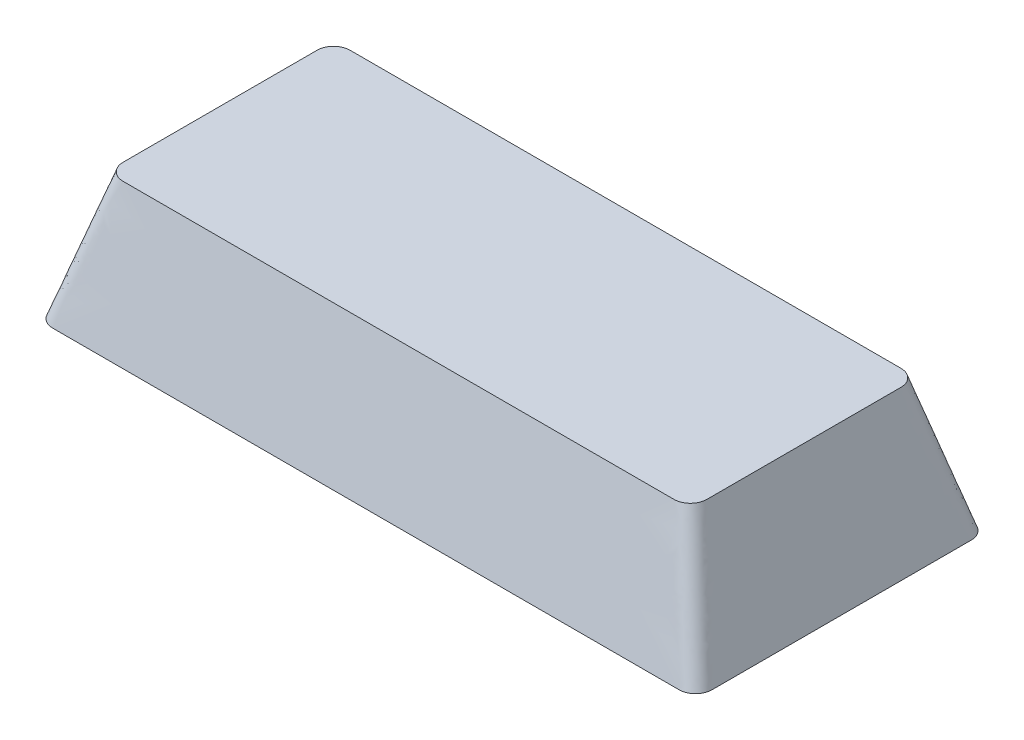
ISO-10303-21;
HEADER;
FILE_DESCRIPTION(('STEP AP214'),'2;1');
FILE_NAME('part.step','',(''),(''),'','','');
FILE_SCHEMA(('AUTOMOTIVE_DESIGN { 1 0 10303 214 1 1 1 1 }'));
ENDSEC;
DATA;
#1=APPLICATION_CONTEXT('core data for automotive mechanical design processes');
#2=APPLICATION_PROTOCOL_DEFINITION('international standard','automotive_design',2000,#1);
#3=PRODUCT_CONTEXT('',#1,'mechanical');
#4=PRODUCT('Part','Part','',(#3));
#5=PRODUCT_RELATED_PRODUCT_CATEGORY('part','',(#4));
#6=PRODUCT_DEFINITION_FORMATION('','',#4);
#7=PRODUCT_DEFINITION_CONTEXT('part definition',#1,'design');
#8=PRODUCT_DEFINITION('design','',#6,#7);
#9=PRODUCT_DEFINITION_SHAPE('','',#8);
#10=(LENGTH_UNIT() NAMED_UNIT(*) SI_UNIT(.MILLI.,.METRE.));
#11=(NAMED_UNIT(*) PLANE_ANGLE_UNIT() SI_UNIT($,.RADIAN.));
#12=(NAMED_UNIT(*) SI_UNIT($,.STERADIAN.) SOLID_ANGLE_UNIT());
#13=UNCERTAINTY_MEASURE_WITH_UNIT(LENGTH_MEASURE(1.E-05),#10,'distance_accuracy_value','');
#14=(GEOMETRIC_REPRESENTATION_CONTEXT(3) GLOBAL_UNCERTAINTY_ASSIGNED_CONTEXT((#13)) GLOBAL_UNIT_ASSIGNED_CONTEXT((#10,
#11,#12)) REPRESENTATION_CONTEXT('',''));
#15=CARTESIAN_POINT('',(0.,0.,0.));
#16=DIRECTION('',(0.,0.,1.));
#17=DIRECTION('',(1.,0.,0.));
#18=AXIS2_PLACEMENT_3D('',#15,#16,#17);
#19=CARTESIAN_POINT('',(-19.304,0.,-7.9883));
#20=DIRECTION('',(0.,-1.,0.));
#21=DIRECTION('',(0.,0.,-1.));
#22=AXIS2_PLACEMENT_3D('',#19,#20,#21);
#23=PLANE('',#22);
#24=CARTESIAN_POINT('',(-19.304,0.,-7.9883));
#25=DIRECTION('',(0.,1.,0.));
#26=DIRECTION('',(0.,0.,-1.));
#27=AXIS2_PLACEMENT_3D('',#24,#25,#26);
#28=CIRCLE('',#27,1.016);
#29=CARTESIAN_POINT('',(-19.3039999999098,0.,-9.0043));
#30=VERTEX_POINT('',#29);
#31=CARTESIAN_POINT('',(-20.32,0.,-7.9883));
#32=VERTEX_POINT('',#31);
#33=EDGE_CURVE('E308',#30,#32,#28,.T.);
#34=ORIENTED_EDGE('',*,*,#33,.F.);
#35=DIRECTION('',(-1.,0.,0.));
#36=VECTOR('',#35,1.);
#37=CARTESIAN_POINT('',(-19.304,0.,-9.0043));
#38=LINE('',#37,#36);
#39=CARTESIAN_POINT('',(19.3039999999883,0.,-9.0043));
#40=VERTEX_POINT('',#39);
#41=EDGE_CURVE('E540',#40,#30,#38,.T.);
#42=ORIENTED_EDGE('',*,*,#41,.F.);
#43=CARTESIAN_POINT('',(19.304,0.,-7.9883));
#44=DIRECTION('',(0.,1.,0.));
#45=DIRECTION('',(0.,0.,-1.));
#46=AXIS2_PLACEMENT_3D('',#43,#44,#45);
#47=CIRCLE('',#46,1.016);
#48=CARTESIAN_POINT('',(20.32,0.,-7.98829999974556));
#49=VERTEX_POINT('',#48);
#50=EDGE_CURVE('E531',#49,#40,#47,.T.);
#51=ORIENTED_EDGE('',*,*,#50,.F.);
#52=DIRECTION('',(0.,0.,-1.));
#53=VECTOR('',#52,1.);
#54=CARTESIAN_POINT('',(20.32,0.,7.9883));
#55=LINE('',#54,#53);
#56=CARTESIAN_POINT('',(20.32,0.,7.98829999944352));
#57=VERTEX_POINT('',#56);
#58=EDGE_CURVE('E522',#57,#49,#55,.T.);
#59=ORIENTED_EDGE('',*,*,#58,.F.);
#60=CARTESIAN_POINT('',(19.304,0.,7.9883));
#61=DIRECTION('',(0.,1.,0.));
#62=DIRECTION('',(0.,0.,1.));
#63=AXIS2_PLACEMENT_3D('',#60,#61,#62);
#64=CIRCLE('',#63,1.016);
#65=CARTESIAN_POINT('',(19.3039999999101,0.,9.0043));
#66=VERTEX_POINT('',#65);
#67=EDGE_CURVE('E513',#66,#57,#64,.T.);
#68=ORIENTED_EDGE('',*,*,#67,.F.);
#69=DIRECTION('',(1.,0.,0.));
#70=VECTOR('',#69,1.);
#71=CARTESIAN_POINT('',(-19.304,0.,9.0043));
#72=LINE('',#71,#70);
#73=CARTESIAN_POINT('',(-19.3039999999883,0.,9.0043));
#74=VERTEX_POINT('',#73);
#75=EDGE_CURVE('E507',#74,#66,#72,.T.);
#76=ORIENTED_EDGE('',*,*,#75,.F.);
#77=CARTESIAN_POINT('',(-19.304,0.,7.9883));
#78=DIRECTION('',(0.,1.,0.));
#79=DIRECTION('',(0.,0.,-1.));
#80=AXIS2_PLACEMENT_3D('',#77,#78,#79);
#81=CIRCLE('',#80,1.016);
#82=CARTESIAN_POINT('',(-20.32,0.,7.9883));
#83=VERTEX_POINT('',#82);
#84=EDGE_CURVE('E241',#83,#74,#81,.T.);
#85=ORIENTED_EDGE('',*,*,#84,.F.);
#86=DIRECTION('',(0.,0.,1.));
#87=VECTOR('',#86,1.);
#88=CARTESIAN_POINT('',(-20.32,0.,7.9883));
#89=LINE('',#88,#87);
#90=EDGE_CURVE('E12',#32,#83,#89,.T.);
#91=ORIENTED_EDGE('',*,*,#90,.F.);
#92=EDGE_LOOP('',(#34,#42,#51,#59,#68,#76,#85,#91));
#93=FACE_BOUND('',#92,.T.);
#94=ADVANCED_FACE('F231',(#93),#23,.T.);
#95=CARTESIAN_POINT('',(16.9799,8.001,-5.9817));
#96=DIRECTION('',(0.,-1.,0.));
#97=DIRECTION('',(0.,0.,-1.));
#98=AXIS2_PLACEMENT_3D('',#95,#96,#97);
#99=PLANE('',#98);
#100=CARTESIAN_POINT('',(16.9799,8.001,-5.9817));
#101=DIRECTION('',(0.,1.,0.));
#102=DIRECTION('',(0.,0.,-1.));
#103=AXIS2_PLACEMENT_3D('',#100,#101,#102);
#104=CIRCLE('',#103,1.016);
#105=CARTESIAN_POINT('',(17.9959,8.001,-5.9817));
#106=VERTEX_POINT('',#105);
#107=CARTESIAN_POINT('',(16.9799,8.001,-6.9977));
#108=VERTEX_POINT('',#107);
#109=EDGE_CURVE('E304',#106,#108,#104,.T.);
#110=ORIENTED_EDGE('',*,*,#109,.T.);
#111=DIRECTION('',(-1.,0.,0.));
#112=VECTOR('',#111,1.);
#113=CARTESIAN_POINT('',(-16.9799,8.001,-6.9977));
#114=LINE('',#113,#112);
#115=CARTESIAN_POINT('',(-16.9799,8.001,-6.9977));
#116=VERTEX_POINT('',#115);
#117=EDGE_CURVE('E296',#108,#116,#114,.T.);
#118=ORIENTED_EDGE('',*,*,#117,.T.);
#119=CARTESIAN_POINT('',(-16.9799,8.001,-5.9817));
#120=DIRECTION('',(0.,1.,0.));
#121=DIRECTION('',(0.,0.,-1.));
#122=AXIS2_PLACEMENT_3D('',#119,#120,#121);
#123=CIRCLE('',#122,1.016);
#124=CARTESIAN_POINT('',(-17.9959,8.001,-5.9817));
#125=VERTEX_POINT('',#124);
#126=EDGE_CURVE('E300',#116,#125,#123,.T.);
#127=ORIENTED_EDGE('',*,*,#126,.T.);
#128=DIRECTION('',(0.,0.,1.));
#129=VECTOR('',#128,1.);
#130=CARTESIAN_POINT('',(-17.9959,8.001,5.9817));
#131=LINE('',#130,#129);
#132=CARTESIAN_POINT('',(-17.9959,8.001,5.9817));
#133=VERTEX_POINT('',#132);
#134=EDGE_CURVE('E315',#125,#133,#131,.T.);
#135=ORIENTED_EDGE('',*,*,#134,.T.);
#136=CARTESIAN_POINT('',(-16.9799,8.001,5.9817));
#137=DIRECTION('',(0.,1.,0.));
#138=DIRECTION('',(0.,0.,-1.));
#139=AXIS2_PLACEMENT_3D('',#136,#137,#138);
#140=CIRCLE('',#139,1.016);
#141=CARTESIAN_POINT('',(-16.9799,8.001,6.9977));
#142=VERTEX_POINT('',#141);
#143=EDGE_CURVE('E439',#133,#142,#140,.T.);
#144=ORIENTED_EDGE('',*,*,#143,.T.);
#145=DIRECTION('',(1.,0.,0.));
#146=VECTOR('',#145,1.);
#147=CARTESIAN_POINT('',(-16.9799,8.001,6.9977));
#148=LINE('',#147,#146);
#149=CARTESIAN_POINT('',(16.9799,8.001,6.9977));
#150=VERTEX_POINT('',#149);
#151=EDGE_CURVE('E456',#142,#150,#148,.T.);
#152=ORIENTED_EDGE('',*,*,#151,.T.);
#153=CARTESIAN_POINT('',(16.9799,8.001,5.9817));
#154=DIRECTION('',(0.,1.,0.));
#155=DIRECTION('',(0.,0.,1.));
#156=AXIS2_PLACEMENT_3D('',#153,#154,#155);
#157=CIRCLE('',#156,1.016);
#158=CARTESIAN_POINT('',(17.9959,8.001,5.9817));
#159=VERTEX_POINT('',#158);
#160=EDGE_CURVE('E459',#150,#159,#157,.T.);
#161=ORIENTED_EDGE('',*,*,#160,.T.);
#162=DIRECTION('',(0.,0.,-1.));
#163=VECTOR('',#162,1.);
#164=CARTESIAN_POINT('',(17.9959,8.001,5.9817));
#165=LINE('',#164,#163);
#166=EDGE_CURVE('E477',#159,#106,#165,.T.);
#167=ORIENTED_EDGE('',*,*,#166,.T.);
#168=EDGE_LOOP('',(#110,#118,#127,#135,#144,#152,#161,#167));
#169=FACE_BOUND('',#168,.T.);
#170=ADVANCED_FACE('F299',(#169),#99,.F.);
#171=CARTESIAN_POINT('',(-16.9798999992183,8.001,-6.9977));
#172=CARTESIAN_POINT('',(-19.3039999991161,0.,-9.0043));
#173=CARTESIAN_POINT('',(-14.1423805942969,8.001,-6.9977));
#174=CARTESIAN_POINT('',(-16.0955317191843,0.,-9.0043));
#175=CARTESIAN_POINT('',(-8.47869031546138,8.001,-6.99770000000001));
#176=CARTESIAN_POINT('',(-9.66535195745911,0.,-9.0043));
#177=CARTESIAN_POINT('',(0.,8.001,-6.99769999999999));
#178=CARTESIAN_POINT('',(0.,0.,-9.0043));
#179=CARTESIAN_POINT('',(8.47869031546139,8.001,-6.99770000000001));
#180=CARTESIAN_POINT('',(9.6653519574591,0.,-9.0043));
#181=CARTESIAN_POINT('',(14.1423805942969,8.001,-6.9977));
#182=CARTESIAN_POINT('',(16.0955317191843,0.,-9.0043));
#183=CARTESIAN_POINT('',(17.1053580158159,8.001,-6.9977));
#184=CARTESIAN_POINT('',(19.4458591405966,0.,-9.0043));
#185=CARTESIAN_POINT('',(17.3720729938604,8.001,-6.95025212691877));
#186=CARTESIAN_POINT('',(19.7095524259339,0.,-8.94623217822048));
#187=CARTESIAN_POINT('',(17.7326931276963,8.00099999999999,-6.70844537171602));
#188=CARTESIAN_POINT('',(20.0302566857618,0.,-8.73242789602578));
#189=CARTESIAN_POINT('',(17.9550744458852,8.00100000000001,-6.34920110585218));
#190=CARTESIAN_POINT('',(20.254526794224,0.,-8.41347537305188));
#191=CARTESIAN_POINT('',(17.9959,8.001,-6.09877274091042));
#192=CARTESIAN_POINT('',(20.32,0.,-8.14002315181678));
#193=CARTESIAN_POINT('',(17.9959,8.001,-4.9688286526702));
#194=CARTESIAN_POINT('',(20.32,0.,-6.67564573046869));
#195=CARTESIAN_POINT('',(17.9959,8.00099999999999,-2.96752316535512));
#196=CARTESIAN_POINT('',(20.32,0.,-4.02283714021595));
#197=CARTESIAN_POINT('',(17.9959,8.00100000000001,0.));
#198=CARTESIAN_POINT('',(20.32,0.,0.));
#199=CARTESIAN_POINT('',(17.9959,8.00099999999999,2.96752316535511));
#200=CARTESIAN_POINT('',(20.32,0.,4.02283714021594));
#201=CARTESIAN_POINT('',(17.9959,8.001,4.9688286526702));
#202=CARTESIAN_POINT('',(20.32,0.,6.67564573046869));
#203=CARTESIAN_POINT('',(17.9959,8.001,6.09877274091042));
#204=CARTESIAN_POINT('',(20.32,0.,8.14002315181678));
#205=CARTESIAN_POINT('',(17.9550744458852,8.001,6.34920110585219));
#206=CARTESIAN_POINT('',(20.254526794224,0.,8.41347537305186));
#207=CARTESIAN_POINT('',(17.7326931276963,8.00099999999999,6.70844537171603));
#208=CARTESIAN_POINT('',(20.0302566857618,0.,8.7324278960258));
#209=CARTESIAN_POINT('',(17.3720729938604,8.00100000000001,6.95025212691876));
#210=CARTESIAN_POINT('',(19.7095524259338,0.,8.94623217822046));
#211=CARTESIAN_POINT('',(17.1053580158159,8.001,6.9977));
#212=CARTESIAN_POINT('',(19.4458591405966,0.,9.0043));
#213=CARTESIAN_POINT('',(14.1423805942969,8.001,6.9977));
#214=CARTESIAN_POINT('',(16.0955317191843,0.,9.0043));
#215=CARTESIAN_POINT('',(8.47869031546138,8.00100000000001,6.99770000000001));
#216=CARTESIAN_POINT('',(9.6653519574591,0.,9.0043));
#217=CARTESIAN_POINT('',(0.,8.00099999999999,6.99769999999998));
#218=CARTESIAN_POINT('',(0.,0.,9.0043));
#219=CARTESIAN_POINT('',(-8.47869031546138,8.001,6.99770000000001));
#220=CARTESIAN_POINT('',(-9.66535195745912,0.,9.0043));
#221=CARTESIAN_POINT('',(-14.1423805942969,8.001,6.9977));
#222=CARTESIAN_POINT('',(-16.0955317191843,0.,9.0043));
#223=CARTESIAN_POINT('',(-17.1053580158159,8.001,6.9977));
#224=CARTESIAN_POINT('',(-19.4458591405966,0.,9.0043));
#225=CARTESIAN_POINT('',(-17.3720729938604,8.00099999999999,6.95025212691876));
#226=CARTESIAN_POINT('',(-19.7095524259339,0.,8.94623217822048));
#227=CARTESIAN_POINT('',(-17.7326931276963,8.00100000000001,6.70844537171602));
#228=CARTESIAN_POINT('',(-20.0302566857618,0.,8.73242789602578));
#229=CARTESIAN_POINT('',(-17.9550744458852,8.00099999999999,6.34920110585218));
#230=CARTESIAN_POINT('',(-20.254526794224,0.,8.41347537305188));
#231=CARTESIAN_POINT('',(-17.9959,8.001,6.09877274091042));
#232=CARTESIAN_POINT('',(-20.32,0.,8.14002315181678));
#233=CARTESIAN_POINT('',(-17.9959,8.001,4.9688286526702));
#234=CARTESIAN_POINT('',(-20.32,0.,6.67564573046868));
#235=CARTESIAN_POINT('',(-17.9959,8.001,2.96752316535512));
#236=CARTESIAN_POINT('',(-20.32,0.,4.02283714021593));
#237=CARTESIAN_POINT('',(-17.9959,8.001,0.));
#238=CARTESIAN_POINT('',(-20.32,0.,0.));
#239=CARTESIAN_POINT('',(-17.9959,8.001,-2.96752316535511));
#240=CARTESIAN_POINT('',(-20.32,0.,-4.02283714021594));
#241=CARTESIAN_POINT('',(-17.9959,8.001,-4.9688286526702));
#242=CARTESIAN_POINT('',(-20.32,0.,-6.67564573046869));
#243=CARTESIAN_POINT('',(-17.9959,8.001,-6.09877274091042));
#244=CARTESIAN_POINT('',(-20.32,0.,-8.14002315181678));
#245=CARTESIAN_POINT('',(-17.9550744458852,8.001,-6.34920110585218));
#246=CARTESIAN_POINT('',(-20.2545267942239,0.,-8.41347537305188));
#247=CARTESIAN_POINT('',(-17.7326931276963,8.001,-6.70844537171601));
#248=CARTESIAN_POINT('',(-20.0302566857618,0.,-8.73242789602578));
#249=CARTESIAN_POINT('',(-17.3720729938604,8.001,-6.95025212691876));
#250=CARTESIAN_POINT('',(-19.7095524259338,0.,-8.94623217822048));
#251=CARTESIAN_POINT('',(-17.1053580158159,8.001,-6.9977));
#252=CARTESIAN_POINT('',(-19.4458591405966,0.,-9.0043));
#253=CARTESIAN_POINT('',(-16.9798999992183,8.001,-6.9977));
#254=CARTESIAN_POINT('',(-19.3039999991161,0.,-9.0043));
#255=B_SPLINE_SURFACE_WITH_KNOTS('',3,1,((#171,#172),(#173,#174),(#175,#176),(#177,#178),(#179,
#180),(#181,#182),(#183,#184),(#185,#186),(#187,#188),(#189,#190),(#191,#192),(#193,#194),(#195,
#196),(#197,#198),(#199,#200),(#201,#202),(#203,#204),(#205,#206),(#207,#208),(#209,#210),(#211,
#212),(#213,#214),(#215,#216),(#217,#218),(#219,#220),(#221,#222),(#223,#224),(#225,#226),(#227,
#228),(#229,#230),(#231,#232),(#233,#234),(#235,#236),(#237,#238),(#239,#240),(#241,#242),(#243,
#244),(#245,#246),(#247,#248),(#249,#250),(#251,#252),(#253,#254)),.UNSPECIFIED.,.T.,.F.,.F.,(4,
1,1,1,2,1,1,1,2,1,1,1,2,1,1,1,2,1,1,1,2,1,1,1,2,1,1,1,2,1,1,1,4),(2,2),(0.,0.0849790135763181,
0.169958027152636,0.254937040728954,0.339916054305272,0.343673314423816,0.34743057454236,
0.351187834660904,0.354945094779448,0.387451560966042,0.419958027152636,0.45246449333923,
0.484970959525825,0.488728219644369,0.492485479762912,0.496242739881456,0.5,0.584979013576318,
0.669958027152636,0.754937040728954,0.839916054305272,0.843673314423816,0.84743057454236,
0.851187834660904,0.854945094779448,0.887451560966042,0.919958027152636,0.95246449333923,
0.984970959525825,0.988728219644369,0.992485479762912,0.996242739881456,1.),(0.,1.),.UNSPECIFIED.);
#256=ORIENTED_EDGE('',*,*,#109,.F.);
#257=ORIENTED_EDGE('',*,*,#166,.F.);
#258=ORIENTED_EDGE('',*,*,#160,.F.);
#259=ORIENTED_EDGE('',*,*,#151,.F.);
#260=ORIENTED_EDGE('',*,*,#143,.F.);
#261=ORIENTED_EDGE('',*,*,#134,.F.);
#262=ORIENTED_EDGE('',*,*,#126,.F.);
#263=ORIENTED_EDGE('',*,*,#117,.F.);
#264=EDGE_LOOP('',(#256,#257,#258,#259,#260,#261,#262,#263));
#265=FACE_BOUND('',#264,.T.);
#266=ORIENTED_EDGE('',*,*,#90,.T.);
#267=ORIENTED_EDGE('',*,*,#84,.T.);
#268=ORIENTED_EDGE('',*,*,#75,.T.);
#269=ORIENTED_EDGE('',*,*,#67,.T.);
#270=ORIENTED_EDGE('',*,*,#58,.T.);
#271=ORIENTED_EDGE('',*,*,#50,.T.);
#272=ORIENTED_EDGE('',*,*,#41,.T.);
#273=ORIENTED_EDGE('',*,*,#33,.T.);
#274=EDGE_LOOP('',(#266,#267,#268,#269,#270,#271,#272,#273));
#275=FACE_BOUND('',#274,.T.);
#276=ADVANCED_FACE('F313',(#265,#275),#255,.T.);
#277=CLOSED_SHELL('',(#94,#170,#276));
#278=MANIFOLD_SOLID_BREP('B2',#277);
#279=ADVANCED_BREP_SHAPE_REPRESENTATION('',(#18,#278),#14);
#280=SHAPE_DEFINITION_REPRESENTATION(#9,#279);
ENDSEC;
END-ISO-10303-21;
